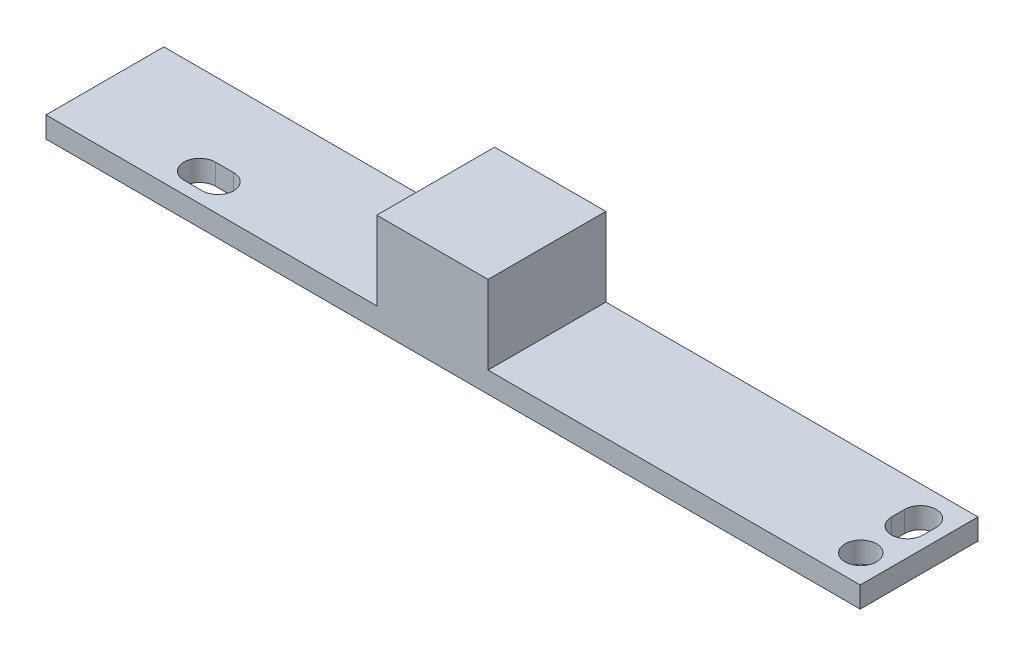
ISO-10303-21;
HEADER;
FILE_DESCRIPTION(('STEP AP214'),'2;1');
FILE_NAME('part.step','',(''),(''),'','','');
FILE_SCHEMA(('AUTOMOTIVE_DESIGN { 1 0 10303 214 1 1 1 1 }'));
ENDSEC;
DATA;
#1=APPLICATION_CONTEXT('core data for automotive mechanical design processes');
#2=APPLICATION_PROTOCOL_DEFINITION('international standard','automotive_design',2000,#1);
#3=PRODUCT_CONTEXT('',#1,'mechanical');
#4=PRODUCT('Part','Part','',(#3));
#5=PRODUCT_RELATED_PRODUCT_CATEGORY('part','',(#4));
#6=PRODUCT_DEFINITION_FORMATION('','',#4);
#7=PRODUCT_DEFINITION_CONTEXT('part definition',#1,'design');
#8=PRODUCT_DEFINITION('design','',#6,#7);
#9=PRODUCT_DEFINITION_SHAPE('','',#8);
#10=(LENGTH_UNIT() NAMED_UNIT(*) SI_UNIT(.MILLI.,.METRE.));
#11=(NAMED_UNIT(*) PLANE_ANGLE_UNIT() SI_UNIT($,.RADIAN.));
#12=(NAMED_UNIT(*) SI_UNIT($,.STERADIAN.) SOLID_ANGLE_UNIT());
#13=UNCERTAINTY_MEASURE_WITH_UNIT(LENGTH_MEASURE(1.E-05),#10,'distance_accuracy_value','');
#14=(GEOMETRIC_REPRESENTATION_CONTEXT(3) GLOBAL_UNCERTAINTY_ASSIGNED_CONTEXT((#13)) GLOBAL_UNIT_ASSIGNED_CONTEXT((#10,
#11,#12)) REPRESENTATION_CONTEXT('',''));
#15=CARTESIAN_POINT('',(0.,0.,0.));
#16=DIRECTION('',(0.,0.,1.));
#17=DIRECTION('',(1.,0.,0.));
#18=AXIS2_PLACEMENT_3D('',#15,#16,#17);
#19=CARTESIAN_POINT('',(0.,1.6,0.));
#20=DIRECTION('',(0.,-1.,0.));
#21=DIRECTION('',(0.,0.,-1.));
#22=AXIS2_PLACEMENT_3D('',#19,#20,#21);
#23=PLANE('',#22);
#24=CARTESIAN_POINT('',(60.0982368250842,1.6,-2.14716450770362));
#25=DIRECTION('',(0.,1.,0.));
#26=DIRECTION('',(0.,0.,1.));
#27=AXIS2_PLACEMENT_3D('',#24,#25,#26);
#28=CIRCLE('',#27,1.20000000000001);
#29=CARTESIAN_POINT('',(60.0982368250842,1.6,-0.947164507703609));
#30=VERTEX_POINT('',#29);
#31=EDGE_CURVE('E171',#30,#30,#28,.T.);
#32=ORIENTED_EDGE('',*,*,#31,.F.);
#33=EDGE_LOOP('',(#32));
#34=FACE_BOUND('',#33,.T.);
#35=DIRECTION('',(0.,0.,1.));
#36=VECTOR('',#35,1.);
#37=CARTESIAN_POINT('',(58.8982368250842,1.6,-6.7));
#38=LINE('',#37,#36);
#39=CARTESIAN_POINT('',(58.8982368250842,1.6,-6.7));
#40=VERTEX_POINT('',#39);
#41=CARTESIAN_POINT('',(58.8982368250842,1.6,-5.7));
#42=VERTEX_POINT('',#41);
#43=EDGE_CURVE('E230',#40,#42,#38,.T.);
#44=ORIENTED_EDGE('',*,*,#43,.F.);
#45=CARTESIAN_POINT('',(60.0982368250842,1.6,-6.7));
#46=DIRECTION('',(0.,1.,0.));
#47=DIRECTION('',(0.,0.,1.));
#48=AXIS2_PLACEMENT_3D('',#45,#46,#47);
#49=CIRCLE('',#48,1.2);
#50=CARTESIAN_POINT('',(61.2982368250842,1.6,-6.7));
#51=VERTEX_POINT('',#50);
#52=EDGE_CURVE('E228',#51,#40,#49,.T.);
#53=ORIENTED_EDGE('',*,*,#52,.F.);
#54=DIRECTION('',(0.,0.,-1.));
#55=VECTOR('',#54,1.);
#56=CARTESIAN_POINT('',(61.2982368250842,1.6,-6.7));
#57=LINE('',#56,#55);
#58=CARTESIAN_POINT('',(61.2982368250842,1.6,-5.7));
#59=VERTEX_POINT('',#58);
#60=EDGE_CURVE('E218',#59,#51,#57,.T.);
#61=ORIENTED_EDGE('',*,*,#60,.F.);
#62=CARTESIAN_POINT('',(60.0982368250842,1.6,-5.7));
#63=DIRECTION('',(0.,1.,0.));
#64=DIRECTION('',(0.,0.,1.));
#65=AXIS2_PLACEMENT_3D('',#62,#63,#64);
#66=CIRCLE('',#65,1.2);
#67=EDGE_CURVE('E233',#42,#59,#66,.T.);
#68=ORIENTED_EDGE('',*,*,#67,.F.);
#69=EDGE_LOOP('',(#44,#53,#61,#68));
#70=FACE_BOUND('',#69,.T.);
#71=DIRECTION('',(0.,0.,-1.));
#72=VECTOR('',#71,1.);
#73=CARTESIAN_POINT('',(33.77,1.6,0.));
#74=LINE('',#73,#72);
#75=CARTESIAN_POINT('',(33.77,1.6,0.));
#76=VERTEX_POINT('',#75);
#77=CARTESIAN_POINT('',(33.77,1.6,-9.));
#78=VERTEX_POINT('',#77);
#79=EDGE_CURVE('E170',#76,#78,#74,.T.);
#80=ORIENTED_EDGE('',*,*,#79,.F.);
#81=DIRECTION('',(1.,0.,0.));
#82=VECTOR('',#81,1.);
#83=CARTESIAN_POINT('',(0.,1.6,0.));
#84=LINE('',#83,#82);
#85=CARTESIAN_POINT('',(62.2,1.6,0.));
#86=VERTEX_POINT('',#85);
#87=EDGE_CURVE('E250',#76,#86,#84,.T.);
#88=ORIENTED_EDGE('',*,*,#87,.T.);
#89=DIRECTION('',(0.,0.,-1.));
#90=VECTOR('',#89,1.);
#91=CARTESIAN_POINT('',(62.2,1.6,0.));
#92=LINE('',#91,#90);
#93=CARTESIAN_POINT('',(62.2,1.6,-9.));
#94=VERTEX_POINT('',#93);
#95=EDGE_CURVE('E254',#86,#94,#92,.T.);
#96=ORIENTED_EDGE('',*,*,#95,.T.);
#97=DIRECTION('',(-1.,0.,0.));
#98=VECTOR('',#97,1.);
#99=CARTESIAN_POINT('',(0.,1.6,-9.));
#100=LINE('',#99,#98);
#101=EDGE_CURVE('E59',#94,#78,#100,.T.);
#102=ORIENTED_EDGE('',*,*,#101,.T.);
#103=EDGE_LOOP('',(#80,#88,#96,#102));
#104=FACE_BOUND('',#103,.T.);
#105=ADVANCED_FACE('F36',(#34,#70,#104),#23,.F.);
#106=DIRECTION('',(1.,0.,0.));
#107=VECTOR('',#106,1.);
#108=CARTESIAN_POINT('',(9.59162817630887,1.6,-0.947164507703616));
#109=LINE('',#108,#107);
#110=CARTESIAN_POINT('',(9.59162817630887,1.6,-0.947164507703616));
#111=VERTEX_POINT('',#110);
#112=CARTESIAN_POINT('',(10.9916281763089,1.6,-0.947164507703616));
#113=VERTEX_POINT('',#112);
#114=EDGE_CURVE('E196',#111,#113,#109,.T.);
#115=ORIENTED_EDGE('',*,*,#114,.F.);
#116=CARTESIAN_POINT('',(9.59162817630887,1.6,-2.14716450770362));
#117=DIRECTION('',(0.,1.,0.));
#118=DIRECTION('',(0.,0.,1.));
#119=AXIS2_PLACEMENT_3D('',#116,#117,#118);
#120=CIRCLE('',#119,1.2);
#121=CARTESIAN_POINT('',(9.59162817630887,1.6,-3.34716450770362));
#122=VERTEX_POINT('',#121);
#123=EDGE_CURVE('E194',#122,#111,#120,.T.);
#124=ORIENTED_EDGE('',*,*,#123,.F.);
#125=DIRECTION('',(-1.,0.,0.));
#126=VECTOR('',#125,1.);
#127=CARTESIAN_POINT('',(9.59162817630887,1.6,-3.34716450770362));
#128=LINE('',#127,#126);
#129=CARTESIAN_POINT('',(10.9916281763089,1.6,-3.34716450770362));
#130=VERTEX_POINT('',#129);
#131=EDGE_CURVE('E184',#130,#122,#128,.T.);
#132=ORIENTED_EDGE('',*,*,#131,.F.);
#133=CARTESIAN_POINT('',(10.9916281763089,1.6,-2.14716450770362));
#134=DIRECTION('',(0.,1.,0.));
#135=DIRECTION('',(0.,0.,1.));
#136=AXIS2_PLACEMENT_3D('',#133,#134,#135);
#137=CIRCLE('',#136,1.2);
#138=EDGE_CURVE('E200',#113,#130,#137,.T.);
#139=ORIENTED_EDGE('',*,*,#138,.F.);
#140=EDGE_LOOP('',(#115,#124,#132,#139));
#141=FACE_BOUND('',#140,.T.);
#142=DIRECTION('',(0.,0.,1.));
#143=VECTOR('',#142,1.);
#144=CARTESIAN_POINT('',(25.27,1.6,0.));
#145=LINE('',#144,#143);
#146=CARTESIAN_POINT('',(25.27,1.6,-9.));
#147=VERTEX_POINT('',#146);
#148=CARTESIAN_POINT('',(25.27,1.6,0.));
#149=VERTEX_POINT('',#148);
#150=EDGE_CURVE('E51',#147,#149,#145,.T.);
#151=ORIENTED_EDGE('',*,*,#150,.F.);
#152=CARTESIAN_POINT('',(0.,1.6,-9.));
#153=VERTEX_POINT('',#152);
#154=EDGE_CURVE('E256',#147,#153,#100,.T.);
#155=ORIENTED_EDGE('',*,*,#154,.T.);
#156=DIRECTION('',(0.,0.,1.));
#157=VECTOR('',#156,1.);
#158=CARTESIAN_POINT('',(0.,1.6,0.));
#159=LINE('',#158,#157);
#160=CARTESIAN_POINT('',(0.,1.6,0.));
#161=VERTEX_POINT('',#160);
#162=EDGE_CURVE('E247',#153,#161,#159,.T.);
#163=ORIENTED_EDGE('',*,*,#162,.T.);
#164=EDGE_CURVE('E252',#161,#149,#84,.T.);
#165=ORIENTED_EDGE('',*,*,#164,.T.);
#166=EDGE_LOOP('',(#151,#155,#163,#165));
#167=FACE_BOUND('',#166,.T.);
#168=ADVANCED_FACE('F287',(#141,#167),#23,.F.);
#169=CARTESIAN_POINT('',(0.,1.6,0.));
#170=DIRECTION('',(1.,0.,0.));
#171=DIRECTION('',(0.,0.,-1.));
#172=AXIS2_PLACEMENT_3D('',#169,#170,#171);
#173=PLANE('',#172);
#174=DIRECTION('',(0.,0.,1.));
#175=VECTOR('',#174,1.);
#176=CARTESIAN_POINT('',(0.,0.,0.));
#177=LINE('',#176,#175);
#178=CARTESIAN_POINT('',(0.,0.,-9.));
#179=VERTEX_POINT('',#178);
#180=CARTESIAN_POINT('',(0.,0.,0.));
#181=VERTEX_POINT('',#180);
#182=EDGE_CURVE('E207',#179,#181,#177,.T.);
#183=ORIENTED_EDGE('',*,*,#182,.T.);
#184=DIRECTION('',(0.,-1.,0.));
#185=VECTOR('',#184,1.);
#186=CARTESIAN_POINT('',(0.,1.6,0.));
#187=LINE('',#186,#185);
#188=EDGE_CURVE('E11',#161,#181,#187,.T.);
#189=ORIENTED_EDGE('',*,*,#188,.F.);
#190=ORIENTED_EDGE('',*,*,#162,.F.);
#191=DIRECTION('',(0.,-1.,0.));
#192=VECTOR('',#191,1.);
#193=CARTESIAN_POINT('',(0.,1.6,-9.));
#194=LINE('',#193,#192);
#195=EDGE_CURVE('E258',#153,#179,#194,.T.);
#196=ORIENTED_EDGE('',*,*,#195,.T.);
#197=EDGE_LOOP('',(#183,#189,#190,#196));
#198=FACE_BOUND('',#197,.T.);
#199=ADVANCED_FACE('F38',(#198),#173,.F.);
#200=CARTESIAN_POINT('',(0.,1.6,0.));
#201=DIRECTION('',(0.,0.,-1.));
#202=DIRECTION('',(-1.,0.,0.));
#203=AXIS2_PLACEMENT_3D('',#200,#201,#202);
#204=PLANE('',#203);
#205=DIRECTION('',(1.,0.,0.));
#206=VECTOR('',#205,1.);
#207=CARTESIAN_POINT('',(0.,0.,0.));
#208=LINE('',#207,#206);
#209=CARTESIAN_POINT('',(62.2,0.,0.));
#210=VERTEX_POINT('',#209);
#211=EDGE_CURVE('E261',#181,#210,#208,.T.);
#212=ORIENTED_EDGE('',*,*,#211,.T.);
#213=DIRECTION('',(0.,-1.,0.));
#214=VECTOR('',#213,1.);
#215=CARTESIAN_POINT('',(62.2,1.6,0.));
#216=LINE('',#215,#214);
#217=EDGE_CURVE('E44',#86,#210,#216,.T.);
#218=ORIENTED_EDGE('',*,*,#217,.F.);
#219=ORIENTED_EDGE('',*,*,#87,.F.);
#220=DIRECTION('',(0.,-1.,0.));
#221=VECTOR('',#220,1.);
#222=CARTESIAN_POINT('',(33.77,7.6,0.));
#223=LINE('',#222,#221);
#224=CARTESIAN_POINT('',(33.77,7.6,0.));
#225=VERTEX_POINT('',#224);
#226=EDGE_CURVE('E293',#225,#76,#223,.T.);
#227=ORIENTED_EDGE('',*,*,#226,.F.);
#228=DIRECTION('',(1.,0.,0.));
#229=VECTOR('',#228,1.);
#230=CARTESIAN_POINT('',(25.27,7.6,0.));
#231=LINE('',#230,#229);
#232=CARTESIAN_POINT('',(25.27,7.6,0.));
#233=VERTEX_POINT('',#232);
#234=EDGE_CURVE('E164',#233,#225,#231,.T.);
#235=ORIENTED_EDGE('',*,*,#234,.F.);
#236=DIRECTION('',(0.,-1.,0.));
#237=VECTOR('',#236,1.);
#238=CARTESIAN_POINT('',(25.27,7.6,0.));
#239=LINE('',#238,#237);
#240=EDGE_CURVE('E176',#233,#149,#239,.T.);
#241=ORIENTED_EDGE('',*,*,#240,.T.);
#242=ORIENTED_EDGE('',*,*,#164,.F.);
#243=ORIENTED_EDGE('',*,*,#188,.T.);
#244=EDGE_LOOP('',(#212,#218,#219,#227,#235,#241,#242,#243));
#245=FACE_BOUND('',#244,.T.);
#246=ADVANCED_FACE('F298',(#245),#204,.F.);
#247=CARTESIAN_POINT('',(62.2,1.6,0.));
#248=DIRECTION('',(-1.,0.,0.));
#249=DIRECTION('',(0.,0.,1.));
#250=AXIS2_PLACEMENT_3D('',#247,#248,#249);
#251=PLANE('',#250);
#252=DIRECTION('',(0.,0.,-1.));
#253=VECTOR('',#252,1.);
#254=CARTESIAN_POINT('',(62.2,0.,0.));
#255=LINE('',#254,#253);
#256=CARTESIAN_POINT('',(62.2,0.,-9.));
#257=VERTEX_POINT('',#256);
#258=EDGE_CURVE('E263',#210,#257,#255,.T.);
#259=ORIENTED_EDGE('',*,*,#258,.T.);
#260=DIRECTION('',(0.,-1.,0.));
#261=VECTOR('',#260,1.);
#262=CARTESIAN_POINT('',(62.2,1.6,-9.));
#263=LINE('',#262,#261);
#264=EDGE_CURVE('E268',#94,#257,#263,.T.);
#265=ORIENTED_EDGE('',*,*,#264,.F.);
#266=ORIENTED_EDGE('',*,*,#95,.F.);
#267=ORIENTED_EDGE('',*,*,#217,.T.);
#268=EDGE_LOOP('',(#259,#265,#266,#267));
#269=FACE_BOUND('',#268,.T.);
#270=ADVANCED_FACE('F275',(#269),#251,.F.);
#271=CARTESIAN_POINT('',(0.,1.6,-9.));
#272=DIRECTION('',(0.,0.,1.));
#273=DIRECTION('',(1.,0.,0.));
#274=AXIS2_PLACEMENT_3D('',#271,#272,#273);
#275=PLANE('',#274);
#276=DIRECTION('',(-1.,0.,0.));
#277=VECTOR('',#276,1.);
#278=CARTESIAN_POINT('',(0.,0.,-9.));
#279=LINE('',#278,#277);
#280=EDGE_CURVE('E251',#257,#179,#279,.T.);
#281=ORIENTED_EDGE('',*,*,#280,.T.);
#282=ORIENTED_EDGE('',*,*,#195,.F.);
#283=ORIENTED_EDGE('',*,*,#154,.F.);
#284=DIRECTION('',(0.,-1.,0.));
#285=VECTOR('',#284,1.);
#286=CARTESIAN_POINT('',(25.27,7.6,-9.));
#287=LINE('',#286,#285);
#288=CARTESIAN_POINT('',(25.27,7.6,-9.));
#289=VERTEX_POINT('',#288);
#290=EDGE_CURVE('E155',#289,#147,#287,.T.);
#291=ORIENTED_EDGE('',*,*,#290,.F.);
#292=DIRECTION('',(-1.,0.,0.));
#293=VECTOR('',#292,1.);
#294=CARTESIAN_POINT('',(25.27,7.6,-9.));
#295=LINE('',#294,#293);
#296=CARTESIAN_POINT('',(33.77,7.6,-9.));
#297=VERTEX_POINT('',#296);
#298=EDGE_CURVE('E148',#297,#289,#295,.T.);
#299=ORIENTED_EDGE('',*,*,#298,.F.);
#300=DIRECTION('',(0.,-1.,0.));
#301=VECTOR('',#300,1.);
#302=CARTESIAN_POINT('',(33.77,7.6,-9.));
#303=LINE('',#302,#301);
#304=EDGE_CURVE('E152',#297,#78,#303,.T.);
#305=ORIENTED_EDGE('',*,*,#304,.T.);
#306=ORIENTED_EDGE('',*,*,#101,.F.);
#307=ORIENTED_EDGE('',*,*,#264,.T.);
#308=EDGE_LOOP('',(#281,#282,#283,#291,#299,#305,#306,#307));
#309=FACE_BOUND('',#308,.T.);
#310=ADVANCED_FACE('F150',(#309),#275,.F.);
#311=CARTESIAN_POINT('',(0.,0.,0.));
#312=DIRECTION('',(0.,-1.,0.));
#313=DIRECTION('',(0.,0.,-1.));
#314=AXIS2_PLACEMENT_3D('',#311,#312,#313);
#315=PLANE('',#314);
#316=CARTESIAN_POINT('',(9.59162817630887,0.,-2.14716450770362));
#317=DIRECTION('',(0.,1.,0.));
#318=DIRECTION('',(0.,0.,1.));
#319=AXIS2_PLACEMENT_3D('',#316,#317,#318);
#320=CIRCLE('',#319,1.2);
#321=CARTESIAN_POINT('',(9.59162817630887,0.,-3.34716450770362));
#322=VERTEX_POINT('',#321);
#323=CARTESIAN_POINT('',(9.59162817630887,0.,-0.947164507703616));
#324=VERTEX_POINT('',#323);
#325=EDGE_CURVE('E180',#322,#324,#320,.T.);
#326=ORIENTED_EDGE('',*,*,#325,.T.);
#327=DIRECTION('',(1.,0.,0.));
#328=VECTOR('',#327,1.);
#329=CARTESIAN_POINT('',(9.59162817630887,0.,-0.947164507703616));
#330=LINE('',#329,#328);
#331=CARTESIAN_POINT('',(10.9916281763089,0.,-0.947164507703616));
#332=VERTEX_POINT('',#331);
#333=EDGE_CURVE('E183',#324,#332,#330,.T.);
#334=ORIENTED_EDGE('',*,*,#333,.T.);
#335=CARTESIAN_POINT('',(10.9916281763089,0.,-2.14716450770362));
#336=DIRECTION('',(0.,1.,0.));
#337=DIRECTION('',(0.,0.,1.));
#338=AXIS2_PLACEMENT_3D('',#335,#336,#337);
#339=CIRCLE('',#338,1.2);
#340=CARTESIAN_POINT('',(10.9916281763089,0.,-3.34716450770362));
#341=VERTEX_POINT('',#340);
#342=EDGE_CURVE('E187',#332,#341,#339,.T.);
#343=ORIENTED_EDGE('',*,*,#342,.T.);
#344=DIRECTION('',(-1.,0.,0.));
#345=VECTOR('',#344,1.);
#346=CARTESIAN_POINT('',(9.59162817630887,0.,-3.34716450770362));
#347=LINE('',#346,#345);
#348=EDGE_CURVE('E190',#341,#322,#347,.T.);
#349=ORIENTED_EDGE('',*,*,#348,.T.);
#350=EDGE_LOOP('',(#326,#334,#343,#349));
#351=FACE_BOUND('',#350,.T.);
#352=CARTESIAN_POINT('',(60.0982368250842,0.,-6.7));
#353=DIRECTION('',(0.,1.,0.));
#354=DIRECTION('',(0.,0.,1.));
#355=AXIS2_PLACEMENT_3D('',#352,#353,#354);
#356=CIRCLE('',#355,1.2);
#357=CARTESIAN_POINT('',(61.2982368250842,0.,-6.7));
#358=VERTEX_POINT('',#357);
#359=CARTESIAN_POINT('',(58.8982368250842,0.,-6.7));
#360=VERTEX_POINT('',#359);
#361=EDGE_CURVE('E214',#358,#360,#356,.T.);
#362=ORIENTED_EDGE('',*,*,#361,.T.);
#363=DIRECTION('',(0.,0.,1.));
#364=VECTOR('',#363,1.);
#365=CARTESIAN_POINT('',(58.8982368250842,0.,-6.7));
#366=LINE('',#365,#364);
#367=CARTESIAN_POINT('',(58.8982368250842,0.,-5.7));
#368=VERTEX_POINT('',#367);
#369=EDGE_CURVE('E217',#360,#368,#366,.T.);
#370=ORIENTED_EDGE('',*,*,#369,.T.);
#371=CARTESIAN_POINT('',(60.0982368250842,0.,-5.7));
#372=DIRECTION('',(0.,1.,0.));
#373=DIRECTION('',(0.,0.,1.));
#374=AXIS2_PLACEMENT_3D('',#371,#372,#373);
#375=CIRCLE('',#374,1.2);
#376=CARTESIAN_POINT('',(61.2982368250842,0.,-5.7));
#377=VERTEX_POINT('',#376);
#378=EDGE_CURVE('E221',#368,#377,#375,.T.);
#379=ORIENTED_EDGE('',*,*,#378,.T.);
#380=DIRECTION('',(0.,0.,-1.));
#381=VECTOR('',#380,1.);
#382=CARTESIAN_POINT('',(61.2982368250842,0.,-6.7));
#383=LINE('',#382,#381);
#384=EDGE_CURVE('E224',#377,#358,#383,.T.);
#385=ORIENTED_EDGE('',*,*,#384,.T.);
#386=EDGE_LOOP('',(#362,#370,#379,#385));
#387=FACE_BOUND('',#386,.T.);
#388=CARTESIAN_POINT('',(60.0982368250842,0.,-2.14716450770362));
#389=DIRECTION('',(0.,1.,0.));
#390=DIRECTION('',(0.,0.,1.));
#391=AXIS2_PLACEMENT_3D('',#388,#389,#390);
#392=CIRCLE('',#391,1.20000000000001);
#393=CARTESIAN_POINT('',(60.0982368250842,0.,-0.947164507703609));
#394=VERTEX_POINT('',#393);
#395=EDGE_CURVE('E174',#394,#394,#392,.T.);
#396=ORIENTED_EDGE('',*,*,#395,.T.);
#397=EDGE_LOOP('',(#396));
#398=FACE_BOUND('',#397,.T.);
#399=ORIENTED_EDGE('',*,*,#182,.F.);
#400=ORIENTED_EDGE('',*,*,#280,.F.);
#401=ORIENTED_EDGE('',*,*,#258,.F.);
#402=ORIENTED_EDGE('',*,*,#211,.F.);
#403=EDGE_LOOP('',(#399,#400,#401,#402));
#404=FACE_BOUND('',#403,.T.);
#405=ADVANCED_FACE('F282',(#351,#387,#398,#404),#315,.T.);
#406=CARTESIAN_POINT('',(60.0982368250842,0.,-2.14716450770362));
#407=DIRECTION('',(0.,1.,0.));
#408=DIRECTION('',(0.,0.,1.));
#409=AXIS2_PLACEMENT_3D('',#406,#407,#408);
#410=CYLINDRICAL_SURFACE('',#409,1.20000000000001);
#411=ORIENTED_EDGE('',*,*,#395,.F.);
#412=EDGE_LOOP('',(#411));
#413=FACE_BOUND('',#412,.T.);
#414=ORIENTED_EDGE('',*,*,#31,.T.);
#415=EDGE_LOOP('',(#414));
#416=FACE_BOUND('',#415,.T.);
#417=ADVANCED_FACE('F310',(#413,#416),#410,.F.);
#418=CARTESIAN_POINT('',(60.0982368250842,0.,-6.7));
#419=DIRECTION('',(0.,1.,0.));
#420=DIRECTION('',(0.,0.,1.));
#421=AXIS2_PLACEMENT_3D('',#418,#419,#420);
#422=CYLINDRICAL_SURFACE('',#421,1.2);
#423=ORIENTED_EDGE('',*,*,#52,.T.);
#424=DIRECTION('',(0.,1.,0.));
#425=VECTOR('',#424,1.);
#426=CARTESIAN_POINT('',(58.8982368250842,0.,-6.7));
#427=LINE('',#426,#425);
#428=EDGE_CURVE('E227',#360,#40,#427,.T.);
#429=ORIENTED_EDGE('',*,*,#428,.F.);
#430=ORIENTED_EDGE('',*,*,#361,.F.);
#431=DIRECTION('',(0.,1.,0.));
#432=VECTOR('',#431,1.);
#433=CARTESIAN_POINT('',(61.2982368250842,0.,-6.7));
#434=LINE('',#433,#432);
#435=EDGE_CURVE('E197',#358,#51,#434,.T.);
#436=ORIENTED_EDGE('',*,*,#435,.T.);
#437=EDGE_LOOP('',(#423,#429,#430,#436));
#438=FACE_BOUND('',#437,.T.);
#439=ADVANCED_FACE('F395',(#438),#422,.F.);
#440=CARTESIAN_POINT('',(61.2982368250842,0.,-6.7));
#441=DIRECTION('',(1.,0.,0.));
#442=DIRECTION('',(0.,0.,-1.));
#443=AXIS2_PLACEMENT_3D('',#440,#441,#442);
#444=PLANE('',#443);
#445=ORIENTED_EDGE('',*,*,#60,.T.);
#446=ORIENTED_EDGE('',*,*,#435,.F.);
#447=ORIENTED_EDGE('',*,*,#384,.F.);
#448=DIRECTION('',(0.,1.,0.));
#449=VECTOR('',#448,1.);
#450=CARTESIAN_POINT('',(61.2982368250842,0.,-5.7));
#451=LINE('',#450,#449);
#452=EDGE_CURVE('E239',#377,#59,#451,.T.);
#453=ORIENTED_EDGE('',*,*,#452,.T.);
#454=EDGE_LOOP('',(#445,#446,#447,#453));
#455=FACE_BOUND('',#454,.T.);
#456=ADVANCED_FACE('F391',(#455),#444,.F.);
#457=CARTESIAN_POINT('',(60.0982368250842,0.,-5.7));
#458=DIRECTION('',(0.,1.,0.));
#459=DIRECTION('',(0.,0.,1.));
#460=AXIS2_PLACEMENT_3D('',#457,#458,#459);
#461=CYLINDRICAL_SURFACE('',#460,1.2);
#462=ORIENTED_EDGE('',*,*,#67,.T.);
#463=ORIENTED_EDGE('',*,*,#452,.F.);
#464=ORIENTED_EDGE('',*,*,#378,.F.);
#465=DIRECTION('',(0.,1.,0.));
#466=VECTOR('',#465,1.);
#467=CARTESIAN_POINT('',(58.8982368250842,0.,-5.7));
#468=LINE('',#467,#466);
#469=EDGE_CURVE('E241',#368,#42,#468,.T.);
#470=ORIENTED_EDGE('',*,*,#469,.T.);
#471=EDGE_LOOP('',(#462,#463,#464,#470));
#472=FACE_BOUND('',#471,.T.);
#473=ADVANCED_FACE('F394',(#472),#461,.F.);
#474=CARTESIAN_POINT('',(58.8982368250842,0.,-6.7));
#475=DIRECTION('',(-1.,0.,0.));
#476=DIRECTION('',(0.,0.,1.));
#477=AXIS2_PLACEMENT_3D('',#474,#475,#476);
#478=PLANE('',#477);
#479=ORIENTED_EDGE('',*,*,#43,.T.);
#480=ORIENTED_EDGE('',*,*,#469,.F.);
#481=ORIENTED_EDGE('',*,*,#369,.F.);
#482=ORIENTED_EDGE('',*,*,#428,.T.);
#483=EDGE_LOOP('',(#479,#480,#481,#482));
#484=FACE_BOUND('',#483,.T.);
#485=ADVANCED_FACE('F389',(#484),#478,.F.);
#486=CARTESIAN_POINT('',(9.59162817630887,0.,-2.14716450770362));
#487=DIRECTION('',(0.,1.,0.));
#488=DIRECTION('',(0.,0.,1.));
#489=AXIS2_PLACEMENT_3D('',#486,#487,#488);
#490=CYLINDRICAL_SURFACE('',#489,1.2);
#491=ORIENTED_EDGE('',*,*,#123,.T.);
#492=DIRECTION('',(0.,1.,0.));
#493=VECTOR('',#492,1.);
#494=CARTESIAN_POINT('',(9.59162817630887,0.,-0.947164507703616));
#495=LINE('',#494,#493);
#496=EDGE_CURVE('E193',#324,#111,#495,.T.);
#497=ORIENTED_EDGE('',*,*,#496,.F.);
#498=ORIENTED_EDGE('',*,*,#325,.F.);
#499=DIRECTION('',(0.,1.,0.));
#500=VECTOR('',#499,1.);
#501=CARTESIAN_POINT('',(9.59162817630887,0.,-3.34716450770362));
#502=LINE('',#501,#500);
#503=EDGE_CURVE('E205',#322,#122,#502,.T.);
#504=ORIENTED_EDGE('',*,*,#503,.T.);
#505=EDGE_LOOP('',(#491,#497,#498,#504));
#506=FACE_BOUND('',#505,.T.);
#507=ADVANCED_FACE('F380',(#506),#490,.F.);
#508=CARTESIAN_POINT('',(9.59162817630887,0.,-3.34716450770362));
#509=DIRECTION('',(0.,0.,-1.));
#510=DIRECTION('',(-1.,0.,0.));
#511=AXIS2_PLACEMENT_3D('',#508,#509,#510);
#512=PLANE('',#511);
#513=ORIENTED_EDGE('',*,*,#131,.T.);
#514=ORIENTED_EDGE('',*,*,#503,.F.);
#515=ORIENTED_EDGE('',*,*,#348,.F.);
#516=DIRECTION('',(0.,1.,0.));
#517=VECTOR('',#516,1.);
#518=CARTESIAN_POINT('',(10.9916281763089,0.,-3.34716450770362));
#519=LINE('',#518,#517);
#520=EDGE_CURVE('E208',#341,#130,#519,.T.);
#521=ORIENTED_EDGE('',*,*,#520,.T.);
#522=EDGE_LOOP('',(#513,#514,#515,#521));
#523=FACE_BOUND('',#522,.T.);
#524=ADVANCED_FACE('F376',(#523),#512,.F.);
#525=CARTESIAN_POINT('',(10.9916281763089,0.,-2.14716450770362));
#526=DIRECTION('',(0.,1.,0.));
#527=DIRECTION('',(0.,0.,1.));
#528=AXIS2_PLACEMENT_3D('',#525,#526,#527);
#529=CYLINDRICAL_SURFACE('',#528,1.2);
#530=ORIENTED_EDGE('',*,*,#138,.T.);
#531=ORIENTED_EDGE('',*,*,#520,.F.);
#532=ORIENTED_EDGE('',*,*,#342,.F.);
#533=DIRECTION('',(0.,1.,0.));
#534=VECTOR('',#533,1.);
#535=CARTESIAN_POINT('',(10.9916281763089,0.,-0.947164507703616));
#536=LINE('',#535,#534);
#537=EDGE_CURVE('E210',#332,#113,#536,.T.);
#538=ORIENTED_EDGE('',*,*,#537,.T.);
#539=EDGE_LOOP('',(#530,#531,#532,#538));
#540=FACE_BOUND('',#539,.T.);
#541=ADVANCED_FACE('F379',(#540),#529,.F.);
#542=CARTESIAN_POINT('',(9.59162817630887,0.,-0.947164507703616));
#543=DIRECTION('',(0.,0.,1.));
#544=DIRECTION('',(1.,0.,0.));
#545=AXIS2_PLACEMENT_3D('',#542,#543,#544);
#546=PLANE('',#545);
#547=ORIENTED_EDGE('',*,*,#114,.T.);
#548=ORIENTED_EDGE('',*,*,#537,.F.);
#549=ORIENTED_EDGE('',*,*,#333,.F.);
#550=ORIENTED_EDGE('',*,*,#496,.T.);
#551=EDGE_LOOP('',(#547,#548,#549,#550));
#552=FACE_BOUND('',#551,.T.);
#553=ADVANCED_FACE('F354',(#552),#546,.F.);
#554=CARTESIAN_POINT('',(33.77,7.6,0.));
#555=DIRECTION('',(-1.,0.,0.));
#556=DIRECTION('',(0.,0.,1.));
#557=AXIS2_PLACEMENT_3D('',#554,#555,#556);
#558=PLANE('',#557);
#559=ORIENTED_EDGE('',*,*,#79,.T.);
#560=ORIENTED_EDGE('',*,*,#304,.F.);
#561=DIRECTION('',(0.,0.,-1.));
#562=VECTOR('',#561,1.);
#563=CARTESIAN_POINT('',(33.77,7.6,0.));
#564=LINE('',#563,#562);
#565=EDGE_CURVE('E159',#225,#297,#564,.T.);
#566=ORIENTED_EDGE('',*,*,#565,.F.);
#567=ORIENTED_EDGE('',*,*,#226,.T.);
#568=EDGE_LOOP('',(#559,#560,#566,#567));
#569=FACE_BOUND('',#568,.T.);
#570=ADVANCED_FACE('F169',(#569),#558,.F.);
#571=CARTESIAN_POINT('',(25.27,7.6,0.));
#572=DIRECTION('',(1.,0.,0.));
#573=DIRECTION('',(0.,0.,-1.));
#574=AXIS2_PLACEMENT_3D('',#571,#572,#573);
#575=PLANE('',#574);
#576=ORIENTED_EDGE('',*,*,#150,.T.);
#577=ORIENTED_EDGE('',*,*,#240,.F.);
#578=DIRECTION('',(0.,0.,1.));
#579=VECTOR('',#578,1.);
#580=CARTESIAN_POINT('',(25.27,7.6,0.));
#581=LINE('',#580,#579);
#582=EDGE_CURVE('E158',#289,#233,#581,.T.);
#583=ORIENTED_EDGE('',*,*,#582,.F.);
#584=ORIENTED_EDGE('',*,*,#290,.T.);
#585=EDGE_LOOP('',(#576,#577,#583,#584));
#586=FACE_BOUND('',#585,.T.);
#587=ADVANCED_FACE('F289',(#586),#575,.F.);
#588=CARTESIAN_POINT('',(0.,7.6,0.));
#589=DIRECTION('',(0.,-1.,0.));
#590=DIRECTION('',(0.,0.,-1.));
#591=AXIS2_PLACEMENT_3D('',#588,#589,#590);
#592=PLANE('',#591);
#593=ORIENTED_EDGE('',*,*,#565,.T.);
#594=ORIENTED_EDGE('',*,*,#298,.T.);
#595=ORIENTED_EDGE('',*,*,#582,.T.);
#596=ORIENTED_EDGE('',*,*,#234,.T.);
#597=EDGE_LOOP('',(#593,#594,#595,#596));
#598=FACE_BOUND('',#597,.T.);
#599=ADVANCED_FACE('F162',(#598),#592,.F.);
#600=CLOSED_SHELL('',(#105,#168,#199,#246,#270,#310,#405,#417,#439,#456,#473,#485,#507,#524,
#541,#553,#570,#587,#599));
#601=MANIFOLD_SOLID_BREP('B2',#600);
#602=ADVANCED_BREP_SHAPE_REPRESENTATION('',(#18,#601),#14);
#603=SHAPE_DEFINITION_REPRESENTATION(#9,#602);
ENDSEC;
END-ISO-10303-21;
